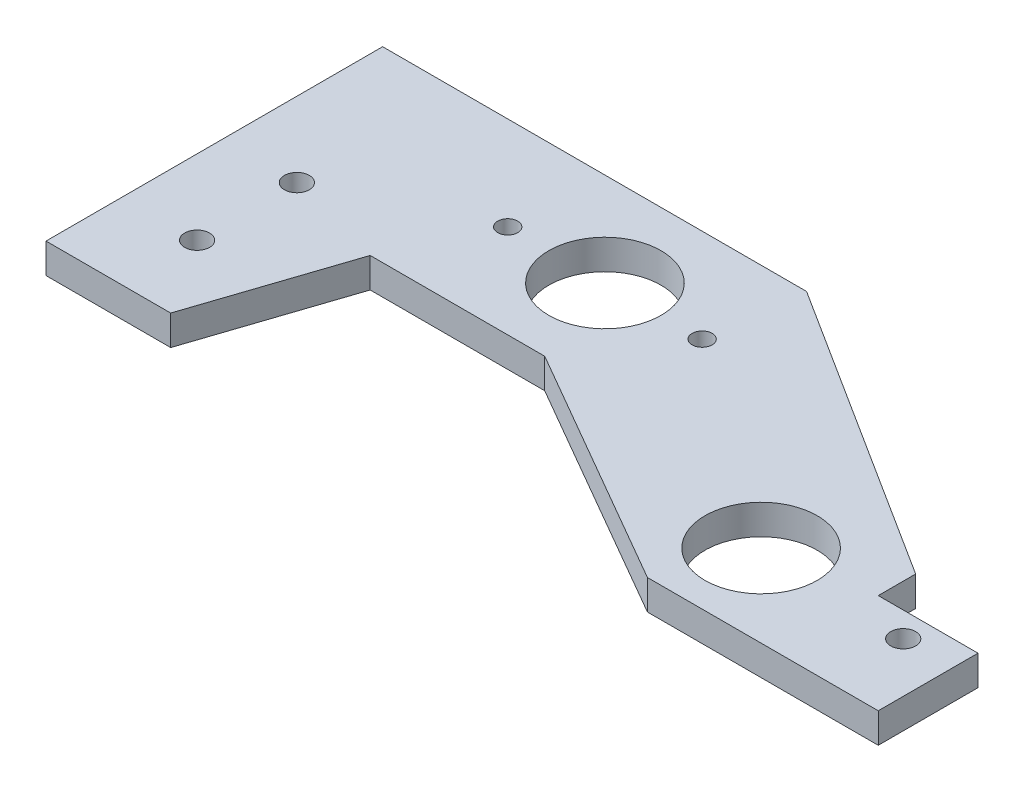
ISO-10303-21;
HEADER;
FILE_DESCRIPTION(('STEP AP214'),'2;1');
FILE_NAME('part.step','',(''),(''),'','','');
FILE_SCHEMA(('AUTOMOTIVE_DESIGN { 1 0 10303 214 1 1 1 1 }'));
ENDSEC;
DATA;
#1=APPLICATION_CONTEXT('core data for automotive mechanical design processes');
#2=APPLICATION_PROTOCOL_DEFINITION('international standard','automotive_design',2000,#1);
#3=PRODUCT_CONTEXT('',#1,'mechanical');
#4=PRODUCT('Part','Part','',(#3));
#5=PRODUCT_RELATED_PRODUCT_CATEGORY('part','',(#4));
#6=PRODUCT_DEFINITION_FORMATION('','',#4);
#7=PRODUCT_DEFINITION_CONTEXT('part definition',#1,'design');
#8=PRODUCT_DEFINITION('design','',#6,#7);
#9=PRODUCT_DEFINITION_SHAPE('','',#8);
#10=(LENGTH_UNIT() NAMED_UNIT(*) SI_UNIT(.MILLI.,.METRE.));
#11=(NAMED_UNIT(*) PLANE_ANGLE_UNIT() SI_UNIT($,.RADIAN.));
#12=(NAMED_UNIT(*) SI_UNIT($,.STERADIAN.) SOLID_ANGLE_UNIT());
#13=UNCERTAINTY_MEASURE_WITH_UNIT(LENGTH_MEASURE(1.E-05),#10,'distance_accuracy_value','');
#14=(GEOMETRIC_REPRESENTATION_CONTEXT(3) GLOBAL_UNCERTAINTY_ASSIGNED_CONTEXT((#13)) GLOBAL_UNIT_ASSIGNED_CONTEXT((#10,
#11,#12)) REPRESENTATION_CONTEXT('',''));
#15=CARTESIAN_POINT('',(0.,0.,0.));
#16=DIRECTION('',(0.,0.,1.));
#17=DIRECTION('',(1.,0.,0.));
#18=AXIS2_PLACEMENT_3D('',#15,#16,#17);
#19=CARTESIAN_POINT('',(25.4,7.62,-13.9541893614266));
#20=DIRECTION('',(-1.,0.,0.));
#21=DIRECTION('',(0.,0.,1.));
#22=AXIS2_PLACEMENT_3D('',#19,#20,#21);
#23=PLANE('',#22);
#24=DIRECTION('',(0.,1.,0.));
#25=VECTOR('',#24,1.);
#26=CARTESIAN_POINT('',(25.4,-35.9210244842766,-4.42918936142656));
#27=LINE('',#26,#25);
#28=CARTESIAN_POINT('',(25.4,0.,-4.42918936142656));
#29=VERTEX_POINT('',#28);
#30=CARTESIAN_POINT('',(25.4,7.62,-4.42918936142656));
#31=VERTEX_POINT('',#30);
#32=EDGE_CURVE('E195',#29,#31,#27,.T.);
#33=ORIENTED_EDGE('',*,*,#32,.F.);
#34=DIRECTION('',(0.,0.,-1.));
#35=VECTOR('',#34,1.);
#36=CARTESIAN_POINT('',(25.4,0.,-13.9541893614266));
#37=LINE('',#36,#35);
#38=CARTESIAN_POINT('',(25.4,0.,-13.9541893614266));
#39=VERTEX_POINT('',#38);
#40=EDGE_CURVE('E299',#29,#39,#37,.T.);
#41=ORIENTED_EDGE('',*,*,#40,.T.);
#42=DIRECTION('',(0.,-1.,0.));
#43=VECTOR('',#42,1.);
#44=CARTESIAN_POINT('',(25.4,7.62,-13.9541893614266));
#45=LINE('',#44,#43);
#46=CARTESIAN_POINT('',(25.4,7.62,-13.9541893614266));
#47=VERTEX_POINT('',#46);
#48=EDGE_CURVE('E11',#47,#39,#45,.T.);
#49=ORIENTED_EDGE('',*,*,#48,.F.);
#50=DIRECTION('',(0.,0.,-1.));
#51=VECTOR('',#50,1.);
#52=CARTESIAN_POINT('',(25.4,7.62,-13.9541893614266));
#53=LINE('',#52,#51);
#54=EDGE_CURVE('E203',#31,#47,#53,.T.);
#55=ORIENTED_EDGE('',*,*,#54,.F.);
#56=EDGE_LOOP('',(#33,#41,#49,#55));
#57=FACE_BOUND('',#56,.T.);
#58=ADVANCED_FACE('F38',(#57),#23,.F.);
#59=CARTESIAN_POINT('',(0.,7.62,0.));
#60=DIRECTION('',(0.,-1.,0.));
#61=DIRECTION('',(0.,0.,-1.));
#62=AXIS2_PLACEMENT_3D('',#59,#60,#61);
#63=PLANE('',#62);
#64=CARTESIAN_POINT('',(-139.7,7.62,3.91987871720376));
#65=DIRECTION('',(0.,1.,0.));
#66=DIRECTION('',(0.,0.,1.));
#67=AXIS2_PLACEMENT_3D('',#64,#65,#66);
#68=CIRCLE('',#67,3.175);
#69=CARTESIAN_POINT('',(-139.7,7.62,7.09487871720376));
#70=VERTEX_POINT('',#69);
#71=EDGE_CURVE('E138',#70,#70,#68,.T.);
#72=ORIENTED_EDGE('',*,*,#71,.F.);
#73=EDGE_LOOP('',(#72));
#74=FACE_BOUND('',#73,.T.);
#75=CARTESIAN_POINT('',(-139.7,7.62,-21.4801212827962));
#76=DIRECTION('',(0.,1.,0.));
#77=DIRECTION('',(0.,0.,1.));
#78=AXIS2_PLACEMENT_3D('',#75,#76,#77);
#79=CIRCLE('',#78,3.175);
#80=CARTESIAN_POINT('',(-139.7,7.62,-18.3051212827962));
#81=VERTEX_POINT('',#80);
#82=EDGE_CURVE('E150',#81,#81,#79,.T.);
#83=ORIENTED_EDGE('',*,*,#82,.F.);
#84=EDGE_LOOP('',(#83));
#85=FACE_BOUND('',#84,.T.);
#86=DIRECTION('',(1.,0.,0.));
#87=VECTOR('',#86,1.);
#88=CARTESIAN_POINT('',(-152.4,7.62,-14.7491212827962));
#89=LINE('',#88,#87);
#90=CARTESIAN_POINT('',(-114.3,7.62,-14.7491212827962));
#91=VERTEX_POINT('',#90);
#92=CARTESIAN_POINT('',(-69.85,7.62,-14.7491212827962));
#93=VERTEX_POINT('',#92);
#94=EDGE_CURVE('E63',#91,#93,#89,.T.);
#95=ORIENTED_EDGE('',*,*,#94,.T.);
#96=DIRECTION('',(-0.866025403784439,0.,-0.5));
#97=VECTOR('',#96,1.);
#98=CARTESIAN_POINT('',(-69.85,7.62,-14.7491212827962));
#99=LINE('',#98,#97);
#100=CARTESIAN_POINT('',(-7.98126306928625,7.62,20.9708106385734));
#101=VERTEX_POINT('',#100);
#102=EDGE_CURVE('E127',#101,#93,#99,.T.);
#103=ORIENTED_EDGE('',*,*,#102,.F.);
#104=DIRECTION('',(1.,0.,0.));
#105=VECTOR('',#104,1.);
#106=CARTESIAN_POINT('',(-14.3312630692865,7.62,20.9708106385734));
#107=LINE('',#106,#105);
#108=CARTESIAN_POINT('',(50.8,7.62,20.9708106385734));
#109=VERTEX_POINT('',#108);
#110=EDGE_CURVE('E132',#101,#109,#107,.T.);
#111=ORIENTED_EDGE('',*,*,#110,.T.);
#112=DIRECTION('',(0.,0.,-1.));
#113=VECTOR('',#112,1.);
#114=CARTESIAN_POINT('',(50.8,7.62,20.9708106385734));
#115=LINE('',#114,#113);
#116=CARTESIAN_POINT('',(50.8,7.62,-4.42918936142656));
#117=VERTEX_POINT('',#116);
#118=EDGE_CURVE('E179',#109,#117,#115,.T.);
#119=ORIENTED_EDGE('',*,*,#118,.T.);
#120=DIRECTION('',(-1.,0.,0.));
#121=VECTOR('',#120,1.);
#122=CARTESIAN_POINT('',(50.8,7.62,-4.42918936142656));
#123=LINE('',#122,#121);
#124=EDGE_CURVE('E182',#117,#31,#123,.T.);
#125=ORIENTED_EDGE('',*,*,#124,.T.);
#126=ORIENTED_EDGE('',*,*,#54,.T.);
#127=DIRECTION('',(-0.844017389806794,0.,-0.536315807807048));
#128=VECTOR('',#127,1.);
#129=CARTESIAN_POINT('',(25.4,7.62,-13.9541893614266));
#130=LINE('',#129,#128);
#131=CARTESIAN_POINT('',(-50.8,7.62,-62.3741212827962));
#132=VERTEX_POINT('',#131);
#133=EDGE_CURVE('E288',#47,#132,#130,.T.);
#134=ORIENTED_EDGE('',*,*,#133,.T.);
#135=DIRECTION('',(-1.,0.,0.));
#136=VECTOR('',#135,1.);
#137=CARTESIAN_POINT('',(-50.8,7.62,-62.3741212827962));
#138=LINE('',#137,#136);
#139=CARTESIAN_POINT('',(-158.75,7.62,-62.3741212827962));
#140=VERTEX_POINT('',#139);
#141=EDGE_CURVE('E293',#132,#140,#138,.T.);
#142=ORIENTED_EDGE('',*,*,#141,.T.);
#143=DIRECTION('',(0.,0.,1.));
#144=VECTOR('',#143,1.);
#145=CARTESIAN_POINT('',(-158.75,7.62,23.3508787172038));
#146=LINE('',#145,#144);
#147=CARTESIAN_POINT('',(-158.75,7.62,23.3508787172038));
#148=VERTEX_POINT('',#147);
#149=EDGE_CURVE('E154',#140,#148,#146,.T.);
#150=ORIENTED_EDGE('',*,*,#149,.T.);
#151=DIRECTION('',(1.,0.,0.));
#152=VECTOR('',#151,1.);
#153=CARTESIAN_POINT('',(-152.4,7.62,23.3508787172038));
#154=LINE('',#153,#152);
#155=CARTESIAN_POINT('',(-127.,7.62,23.3508787172038));
#156=VERTEX_POINT('',#155);
#157=EDGE_CURVE('E157',#148,#156,#154,.T.);
#158=ORIENTED_EDGE('',*,*,#157,.T.);
#159=DIRECTION('',(0.316227766016838,0.,-0.948683298050514));
#160=VECTOR('',#159,1.);
#161=CARTESIAN_POINT('',(-127.,7.62,23.3508787172038));
#162=LINE('',#161,#160);
#163=EDGE_CURVE('E131',#156,#91,#162,.T.);
#164=ORIENTED_EDGE('',*,*,#163,.T.);
#165=EDGE_LOOP('',(#95,#103,#111,#119,#125,#126,#134,#142,#150,#158,#164));
#166=FACE_BOUND('',#165,.T.);
#167=CARTESIAN_POINT('',(-53.5833497406653,7.62,-38.5616212827962));
#168=DIRECTION('',(0.,1.,0.));
#169=DIRECTION('',(0.,0.,1.));
#170=AXIS2_PLACEMENT_3D('',#167,#168,#169);
#171=CIRCLE('',#170,2.5527);
#172=CARTESIAN_POINT('',(-53.5833497406653,7.62,-36.0089212827962));
#173=VERTEX_POINT('',#172);
#174=EDGE_CURVE('E190',#173,#173,#171,.T.);
#175=ORIENTED_EDGE('',*,*,#174,.F.);
#176=EDGE_LOOP('',(#175));
#177=FACE_BOUND('',#176,.T.);
#178=CARTESIAN_POINT('',(-103.087949740665,7.62,-38.5616212827962));
#179=DIRECTION('',(0.,1.,0.));
#180=DIRECTION('',(0.,0.,1.));
#181=AXIS2_PLACEMENT_3D('',#178,#179,#180);
#182=CIRCLE('',#181,2.55270000000001);
#183=CARTESIAN_POINT('',(-103.087949740665,7.62,-36.0089212827962));
#184=VERTEX_POINT('',#183);
#185=EDGE_CURVE('E510',#184,#184,#182,.T.);
#186=ORIENTED_EDGE('',*,*,#185,.F.);
#187=EDGE_LOOP('',(#186));
#188=FACE_BOUND('',#187,.T.);
#189=CARTESIAN_POINT('',(-78.3356497406653,7.62,-38.5616212827962));
#190=DIRECTION('',(0.,1.,0.));
#191=DIRECTION('',(0.,0.,1.));
#192=AXIS2_PLACEMENT_3D('',#189,#190,#191);
#193=CIRCLE('',#192,14.2875);
#194=CARTESIAN_POINT('',(-78.3356497406653,7.62,-24.2741212827963));
#195=VERTEX_POINT('',#194);
#196=EDGE_CURVE('E505',#195,#195,#193,.T.);
#197=ORIENTED_EDGE('',*,*,#196,.F.);
#198=EDGE_LOOP('',(#197));
#199=FACE_BOUND('',#198,.T.);
#200=CARTESIAN_POINT('',(0.,7.62,0.));
#201=DIRECTION('',(0.,1.,0.));
#202=DIRECTION('',(0.,0.,1.));
#203=AXIS2_PLACEMENT_3D('',#200,#201,#202);
#204=CIRCLE('',#203,14.2875);
#205=CARTESIAN_POINT('',(0.,7.62,14.2875));
#206=VERTEX_POINT('',#205);
#207=EDGE_CURVE('E297',#206,#206,#204,.T.);
#208=ORIENTED_EDGE('',*,*,#207,.F.);
#209=EDGE_LOOP('',(#208));
#210=FACE_BOUND('',#209,.T.);
#211=CARTESIAN_POINT('',(38.1,7.62,1.92081063857344));
#212=DIRECTION('',(0.,1.,0.));
#213=DIRECTION('',(0.,0.,1.));
#214=AXIS2_PLACEMENT_3D('',#211,#212,#213);
#215=CIRCLE('',#214,3.175);
#216=CARTESIAN_POINT('',(38.1,7.62,5.09581063857343));
#217=VERTEX_POINT('',#216);
#218=EDGE_CURVE('E183',#217,#217,#215,.T.);
#219=ORIENTED_EDGE('',*,*,#218,.F.);
#220=EDGE_LOOP('',(#219));
#221=FACE_BOUND('',#220,.T.);
#222=ADVANCED_FACE('F124',(#74,#85,#166,#177,#188,#199,#210,#221),#63,.F.);
#223=CARTESIAN_POINT('',(0.,0.,0.));
#224=DIRECTION('',(0.,-1.,0.));
#225=DIRECTION('',(0.,0.,-1.));
#226=AXIS2_PLACEMENT_3D('',#223,#224,#225);
#227=PLANE('',#226);
#228=DIRECTION('',(-0.866025403784439,0.,-0.5));
#229=VECTOR('',#228,1.);
#230=CARTESIAN_POINT('',(-69.85,0.,-14.7491212827962));
#231=LINE('',#230,#229);
#232=CARTESIAN_POINT('',(-7.98126306928624,0.,20.9708106385734));
#233=VERTEX_POINT('',#232);
#234=CARTESIAN_POINT('',(-69.85,0.,-14.7491212827962));
#235=VERTEX_POINT('',#234);
#236=EDGE_CURVE('E55',#233,#235,#231,.T.);
#237=ORIENTED_EDGE('',*,*,#236,.T.);
#238=DIRECTION('',(1.,0.,0.));
#239=VECTOR('',#238,1.);
#240=CARTESIAN_POINT('',(-152.4,0.,-14.7491212827962));
#241=LINE('',#240,#239);
#242=CARTESIAN_POINT('',(-114.3,0.,-14.7491212827962));
#243=VERTEX_POINT('',#242);
#244=EDGE_CURVE('E137',#243,#235,#241,.T.);
#245=ORIENTED_EDGE('',*,*,#244,.F.);
#246=DIRECTION('',(0.316227766016838,0.,-0.948683298050514));
#247=VECTOR('',#246,1.);
#248=CARTESIAN_POINT('',(-127.,0.,23.3508787172038));
#249=LINE('',#248,#247);
#250=CARTESIAN_POINT('',(-127.,0.,23.3508787172038));
#251=VERTEX_POINT('',#250);
#252=EDGE_CURVE('E169',#251,#243,#249,.T.);
#253=ORIENTED_EDGE('',*,*,#252,.F.);
#254=DIRECTION('',(1.,0.,0.));
#255=VECTOR('',#254,1.);
#256=CARTESIAN_POINT('',(-152.4,0.,23.3508787172038));
#257=LINE('',#256,#255);
#258=CARTESIAN_POINT('',(-158.75,0.,23.3508787172038));
#259=VERTEX_POINT('',#258);
#260=EDGE_CURVE('E159',#259,#251,#257,.T.);
#261=ORIENTED_EDGE('',*,*,#260,.F.);
#262=DIRECTION('',(0.,0.,1.));
#263=VECTOR('',#262,1.);
#264=CARTESIAN_POINT('',(-158.75,0.,23.3508787172038));
#265=LINE('',#264,#263);
#266=CARTESIAN_POINT('',(-158.75,0.,-62.3741212827962));
#267=VERTEX_POINT('',#266);
#268=EDGE_CURVE('E164',#267,#259,#265,.T.);
#269=ORIENTED_EDGE('',*,*,#268,.F.);
#270=DIRECTION('',(-1.,0.,0.));
#271=VECTOR('',#270,1.);
#272=CARTESIAN_POINT('',(-50.8,0.,-62.3741212827962));
#273=LINE('',#272,#271);
#274=CARTESIAN_POINT('',(-50.8,0.,-62.3741212827962));
#275=VERTEX_POINT('',#274);
#276=EDGE_CURVE('E133',#275,#267,#273,.T.);
#277=ORIENTED_EDGE('',*,*,#276,.F.);
#278=DIRECTION('',(-0.844017389806794,0.,-0.536315807807048));
#279=VECTOR('',#278,1.);
#280=CARTESIAN_POINT('',(25.4,0.,-13.9541893614266));
#281=LINE('',#280,#279);
#282=EDGE_CURVE('E302',#39,#275,#281,.T.);
#283=ORIENTED_EDGE('',*,*,#282,.F.);
#284=ORIENTED_EDGE('',*,*,#40,.F.);
#285=DIRECTION('',(-1.,0.,0.));
#286=VECTOR('',#285,1.);
#287=CARTESIAN_POINT('',(50.8,0.,-4.42918936142656));
#288=LINE('',#287,#286);
#289=CARTESIAN_POINT('',(50.8,0.,-4.42918936142656));
#290=VERTEX_POINT('',#289);
#291=EDGE_CURVE('E174',#290,#29,#288,.T.);
#292=ORIENTED_EDGE('',*,*,#291,.F.);
#293=DIRECTION('',(0.,0.,-1.));
#294=VECTOR('',#293,1.);
#295=CARTESIAN_POINT('',(50.8,0.,20.9708106385734));
#296=LINE('',#295,#294);
#297=CARTESIAN_POINT('',(50.8,0.,20.9708106385734));
#298=VERTEX_POINT('',#297);
#299=EDGE_CURVE('E191',#298,#290,#296,.T.);
#300=ORIENTED_EDGE('',*,*,#299,.F.);
#301=DIRECTION('',(1.,0.,0.));
#302=VECTOR('',#301,1.);
#303=CARTESIAN_POINT('',(-14.3312630692865,0.,20.9708106385734));
#304=LINE('',#303,#302);
#305=EDGE_CURVE('E296',#233,#298,#304,.T.);
#306=ORIENTED_EDGE('',*,*,#305,.F.);
#307=EDGE_LOOP('',(#237,#245,#253,#261,#269,#277,#283,#284,#292,#300,#306));
#308=FACE_BOUND('',#307,.T.);
#309=CARTESIAN_POINT('',(-139.7,0.,3.91987871720376));
#310=DIRECTION('',(0.,-1.,0.));
#311=DIRECTION('',(0.,0.,-1.));
#312=AXIS2_PLACEMENT_3D('',#309,#310,#311);
#313=CIRCLE('',#312,3.175);
#314=CARTESIAN_POINT('',(-139.7,0.,0.744878717203757));
#315=VERTEX_POINT('',#314);
#316=EDGE_CURVE('E42',#315,#315,#313,.T.);
#317=ORIENTED_EDGE('',*,*,#316,.F.);
#318=EDGE_LOOP('',(#317));
#319=FACE_BOUND('',#318,.T.);
#320=CARTESIAN_POINT('',(-139.7,0.,-21.4801212827962));
#321=DIRECTION('',(0.,-1.,0.));
#322=DIRECTION('',(0.,0.,-1.));
#323=AXIS2_PLACEMENT_3D('',#320,#321,#322);
#324=CIRCLE('',#323,3.175);
#325=CARTESIAN_POINT('',(-139.7,0.,-24.6551212827962));
#326=VERTEX_POINT('',#325);
#327=EDGE_CURVE('E153',#326,#326,#324,.T.);
#328=ORIENTED_EDGE('',*,*,#327,.F.);
#329=EDGE_LOOP('',(#328));
#330=FACE_BOUND('',#329,.T.);
#331=CARTESIAN_POINT('',(-53.5833497406653,0.,-38.5616212827962));
#332=DIRECTION('',(0.,1.,0.));
#333=DIRECTION('',(0.,0.,1.));
#334=AXIS2_PLACEMENT_3D('',#331,#332,#333);
#335=CIRCLE('',#334,2.5527);
#336=CARTESIAN_POINT('',(-53.5833497406653,0.,-36.0089212827962));
#337=VERTEX_POINT('',#336);
#338=EDGE_CURVE('E227',#337,#337,#335,.T.);
#339=ORIENTED_EDGE('',*,*,#338,.T.);
#340=EDGE_LOOP('',(#339));
#341=FACE_BOUND('',#340,.T.);
#342=CARTESIAN_POINT('',(-103.087949740665,0.,-38.5616212827962));
#343=DIRECTION('',(0.,1.,0.));
#344=DIRECTION('',(0.,0.,1.));
#345=AXIS2_PLACEMENT_3D('',#342,#343,#344);
#346=CIRCLE('',#345,2.55270000000001);
#347=CARTESIAN_POINT('',(-103.087949740665,0.,-36.0089212827962));
#348=VERTEX_POINT('',#347);
#349=EDGE_CURVE('E231',#348,#348,#346,.T.);
#350=ORIENTED_EDGE('',*,*,#349,.T.);
#351=EDGE_LOOP('',(#350));
#352=FACE_BOUND('',#351,.T.);
#353=CARTESIAN_POINT('',(-78.3356497406653,0.,-38.5616212827962));
#354=DIRECTION('',(0.,1.,0.));
#355=DIRECTION('',(0.,0.,1.));
#356=AXIS2_PLACEMENT_3D('',#353,#354,#355);
#357=CIRCLE('',#356,14.2875);
#358=CARTESIAN_POINT('',(-78.3356497406653,0.,-24.2741212827963));
#359=VERTEX_POINT('',#358);
#360=EDGE_CURVE('E235',#359,#359,#357,.T.);
#361=ORIENTED_EDGE('',*,*,#360,.T.);
#362=EDGE_LOOP('',(#361));
#363=FACE_BOUND('',#362,.T.);
#364=CARTESIAN_POINT('',(0.,0.,0.));
#365=DIRECTION('',(0.,1.,0.));
#366=DIRECTION('',(0.,0.,1.));
#367=AXIS2_PLACEMENT_3D('',#364,#365,#366);
#368=CIRCLE('',#367,14.2875);
#369=CARTESIAN_POINT('',(0.,0.,14.2875));
#370=VERTEX_POINT('',#369);
#371=EDGE_CURVE('E239',#370,#370,#368,.T.);
#372=ORIENTED_EDGE('',*,*,#371,.T.);
#373=EDGE_LOOP('',(#372));
#374=FACE_BOUND('',#373,.T.);
#375=CARTESIAN_POINT('',(38.1,0.,1.92081063857344));
#376=DIRECTION('',(0.,-1.,0.));
#377=DIRECTION('',(0.,0.,-1.));
#378=AXIS2_PLACEMENT_3D('',#375,#376,#377);
#379=CIRCLE('',#378,3.175);
#380=CARTESIAN_POINT('',(38.1,0.,-1.25418936142656));
#381=VERTEX_POINT('',#380);
#382=EDGE_CURVE('E187',#381,#381,#379,.F.);
#383=ORIENTED_EDGE('',*,*,#382,.T.);
#384=EDGE_LOOP('',(#383));
#385=FACE_BOUND('',#384,.T.);
#386=ADVANCED_FACE('F219',(#308,#319,#330,#341,#352,#363,#374,#385),#227,.T.);
#387=CARTESIAN_POINT('',(-152.4,7.62,-14.7491212827962));
#388=DIRECTION('',(0.,0.,-1.));
#389=DIRECTION('',(-1.,0.,0.));
#390=AXIS2_PLACEMENT_3D('',#387,#388,#389);
#391=PLANE('',#390);
#392=ORIENTED_EDGE('',*,*,#94,.F.);
#393=DIRECTION('',(0.,1.,0.));
#394=VECTOR('',#393,1.);
#395=CARTESIAN_POINT('',(-114.3,-96.5638551684842,-14.7491212827962));
#396=LINE('',#395,#394);
#397=EDGE_CURVE('E172',#243,#91,#396,.T.);
#398=ORIENTED_EDGE('',*,*,#397,.F.);
#399=ORIENTED_EDGE('',*,*,#244,.T.);
#400=DIRECTION('',(0.,1.,0.));
#401=VECTOR('',#400,1.);
#402=CARTESIAN_POINT('',(-69.85,-77.0046076860938,-14.7491212827962));
#403=LINE('',#402,#401);
#404=EDGE_CURVE('E135',#235,#93,#403,.T.);
#405=ORIENTED_EDGE('',*,*,#404,.T.);
#406=EDGE_LOOP('',(#392,#398,#399,#405));
#407=FACE_BOUND('',#406,.T.);
#408=ADVANCED_FACE('F40',(#407),#391,.F.);
#409=CARTESIAN_POINT('',(-14.3312630692865,7.62,20.9708106385734));
#410=DIRECTION('',(0.,0.,-1.));
#411=DIRECTION('',(-1.,0.,0.));
#412=AXIS2_PLACEMENT_3D('',#409,#410,#411);
#413=PLANE('',#412);
#414=ORIENTED_EDGE('',*,*,#110,.F.);
#415=DIRECTION('',(0.,1.,0.));
#416=VECTOR('',#415,1.);
#417=CARTESIAN_POINT('',(-7.98126306928625,-77.0046076860938,20.9708106385734));
#418=LINE('',#417,#416);
#419=EDGE_CURVE('E141',#233,#101,#418,.T.);
#420=ORIENTED_EDGE('',*,*,#419,.F.);
#421=ORIENTED_EDGE('',*,*,#305,.T.);
#422=DIRECTION('',(0.,1.,0.));
#423=VECTOR('',#422,1.);
#424=CARTESIAN_POINT('',(50.8,-35.9210244842766,20.9708106385734));
#425=LINE('',#424,#423);
#426=EDGE_CURVE('E186',#298,#109,#425,.T.);
#427=ORIENTED_EDGE('',*,*,#426,.T.);
#428=EDGE_LOOP('',(#414,#420,#421,#427));
#429=FACE_BOUND('',#428,.T.);
#430=ADVANCED_FACE('F272',(#429),#413,.F.);
#431=CARTESIAN_POINT('',(25.4,7.62,-13.9541893614266));
#432=DIRECTION('',(-0.536315807807048,0.,0.844017389806794));
#433=DIRECTION('',(0.844017389806794,0.,0.536315807807048));
#434=AXIS2_PLACEMENT_3D('',#431,#432,#433);
#435=PLANE('',#434);
#436=ORIENTED_EDGE('',*,*,#282,.T.);
#437=DIRECTION('',(0.,-1.,0.));
#438=VECTOR('',#437,1.);
#439=CARTESIAN_POINT('',(-50.8,7.62,-62.3741212827962));
#440=LINE('',#439,#438);
#441=EDGE_CURVE('E47',#132,#275,#440,.T.);
#442=ORIENTED_EDGE('',*,*,#441,.F.);
#443=ORIENTED_EDGE('',*,*,#133,.F.);
#444=ORIENTED_EDGE('',*,*,#48,.T.);
#445=EDGE_LOOP('',(#436,#442,#443,#444));
#446=FACE_BOUND('',#445,.T.);
#447=ADVANCED_FACE('F270',(#446),#435,.F.);
#448=CARTESIAN_POINT('',(-50.8,7.62,-62.3741212827962));
#449=DIRECTION('',(0.,0.,1.));
#450=DIRECTION('',(1.,0.,0.));
#451=AXIS2_PLACEMENT_3D('',#448,#449,#450);
#452=PLANE('',#451);
#453=ORIENTED_EDGE('',*,*,#276,.T.);
#454=DIRECTION('',(0.,1.,0.));
#455=VECTOR('',#454,1.);
#456=CARTESIAN_POINT('',(-158.75,-96.5638551684842,-62.3741212827962));
#457=LINE('',#456,#455);
#458=EDGE_CURVE('E168',#267,#140,#457,.T.);
#459=ORIENTED_EDGE('',*,*,#458,.T.);
#460=ORIENTED_EDGE('',*,*,#141,.F.);
#461=ORIENTED_EDGE('',*,*,#441,.T.);
#462=EDGE_LOOP('',(#453,#459,#460,#461));
#463=FACE_BOUND('',#462,.T.);
#464=ADVANCED_FACE('F280',(#463),#452,.F.);
#465=CARTESIAN_POINT('',(0.,7.62,0.));
#466=DIRECTION('',(0.,-1.,0.));
#467=DIRECTION('',(0.,0.,-1.));
#468=AXIS2_PLACEMENT_3D('',#465,#466,#467);
#469=CYLINDRICAL_SURFACE('',#468,14.2875);
#470=ORIENTED_EDGE('',*,*,#207,.T.);
#471=EDGE_LOOP('',(#470));
#472=FACE_BOUND('',#471,.T.);
#473=ORIENTED_EDGE('',*,*,#371,.F.);
#474=EDGE_LOOP('',(#473));
#475=FACE_BOUND('',#474,.T.);
#476=ADVANCED_FACE('F352',(#472,#475),#469,.F.);
#477=CARTESIAN_POINT('',(-78.3356497406653,0.,-38.5616212827962));
#478=DIRECTION('',(0.,1.,0.));
#479=DIRECTION('',(0.,0.,1.));
#480=AXIS2_PLACEMENT_3D('',#477,#478,#479);
#481=CYLINDRICAL_SURFACE('',#480,14.2875);
#482=ORIENTED_EDGE('',*,*,#360,.F.);
#483=EDGE_LOOP('',(#482));
#484=FACE_BOUND('',#483,.T.);
#485=ORIENTED_EDGE('',*,*,#196,.T.);
#486=EDGE_LOOP('',(#485));
#487=FACE_BOUND('',#486,.T.);
#488=ADVANCED_FACE('F345',(#484,#487),#481,.F.);
#489=CARTESIAN_POINT('',(-103.087949740665,0.,-38.5616212827962));
#490=DIRECTION('',(0.,1.,0.));
#491=DIRECTION('',(0.,0.,1.));
#492=AXIS2_PLACEMENT_3D('',#489,#490,#491);
#493=CYLINDRICAL_SURFACE('',#492,2.55270000000001);
#494=ORIENTED_EDGE('',*,*,#349,.F.);
#495=EDGE_LOOP('',(#494));
#496=FACE_BOUND('',#495,.T.);
#497=ORIENTED_EDGE('',*,*,#185,.T.);
#498=EDGE_LOOP('',(#497));
#499=FACE_BOUND('',#498,.T.);
#500=ADVANCED_FACE('F340',(#496,#499),#493,.F.);
#501=CARTESIAN_POINT('',(-53.5833497406653,0.,-38.5616212827962));
#502=DIRECTION('',(0.,1.,0.));
#503=DIRECTION('',(0.,0.,1.));
#504=AXIS2_PLACEMENT_3D('',#501,#502,#503);
#505=CYLINDRICAL_SURFACE('',#504,2.5527);
#506=ORIENTED_EDGE('',*,*,#338,.F.);
#507=EDGE_LOOP('',(#506));
#508=FACE_BOUND('',#507,.T.);
#509=ORIENTED_EDGE('',*,*,#174,.T.);
#510=EDGE_LOOP('',(#509));
#511=FACE_BOUND('',#510,.T.);
#512=ADVANCED_FACE('F336',(#508,#511),#505,.F.);
#513=CARTESIAN_POINT('',(50.8,-35.9210244842766,-4.42918936142656));
#514=DIRECTION('',(0.,0.,-1.));
#515=DIRECTION('',(-1.,0.,0.));
#516=AXIS2_PLACEMENT_3D('',#513,#514,#515);
#517=PLANE('',#516);
#518=DIRECTION('',(0.,1.,0.));
#519=VECTOR('',#518,1.);
#520=CARTESIAN_POINT('',(50.8,-35.9210244842766,-4.42918936142656));
#521=LINE('',#520,#519);
#522=EDGE_CURVE('E194',#290,#117,#521,.T.);
#523=ORIENTED_EDGE('',*,*,#522,.F.);
#524=ORIENTED_EDGE('',*,*,#291,.T.);
#525=ORIENTED_EDGE('',*,*,#32,.T.);
#526=ORIENTED_EDGE('',*,*,#124,.F.);
#527=EDGE_LOOP('',(#523,#524,#525,#526));
#528=FACE_BOUND('',#527,.T.);
#529=ADVANCED_FACE('F255',(#528),#517,.T.);
#530=CARTESIAN_POINT('',(50.8,-35.9210244842766,20.9708106385734));
#531=DIRECTION('',(1.,0.,0.));
#532=DIRECTION('',(0.,0.,-1.));
#533=AXIS2_PLACEMENT_3D('',#530,#531,#532);
#534=PLANE('',#533);
#535=ORIENTED_EDGE('',*,*,#426,.F.);
#536=ORIENTED_EDGE('',*,*,#299,.T.);
#537=ORIENTED_EDGE('',*,*,#522,.T.);
#538=ORIENTED_EDGE('',*,*,#118,.F.);
#539=EDGE_LOOP('',(#535,#536,#537,#538));
#540=FACE_BOUND('',#539,.T.);
#541=ADVANCED_FACE('F245',(#540),#534,.T.);
#542=CARTESIAN_POINT('',(38.1,-35.9210244842766,1.92081063857344));
#543=DIRECTION('',(0.,1.,0.));
#544=DIRECTION('',(0.,0.,1.));
#545=AXIS2_PLACEMENT_3D('',#542,#543,#544);
#546=CYLINDRICAL_SURFACE('',#545,3.175);
#547=ORIENTED_EDGE('',*,*,#218,.T.);
#548=EDGE_LOOP('',(#547));
#549=FACE_BOUND('',#548,.T.);
#550=ORIENTED_EDGE('',*,*,#382,.F.);
#551=EDGE_LOOP('',(#550));
#552=FACE_BOUND('',#551,.T.);
#553=ADVANCED_FACE('F242',(#549,#552),#546,.F.);
#554=CARTESIAN_POINT('',(-152.4,-96.5638551684842,23.3508787172038));
#555=DIRECTION('',(0.,0.,1.));
#556=DIRECTION('',(1.,0.,0.));
#557=AXIS2_PLACEMENT_3D('',#554,#555,#556);
#558=PLANE('',#557);
#559=DIRECTION('',(0.,1.,0.));
#560=VECTOR('',#559,1.);
#561=CARTESIAN_POINT('',(-158.75,-96.5638551684842,23.3508787172038));
#562=LINE('',#561,#560);
#563=EDGE_CURVE('E167',#259,#148,#562,.T.);
#564=ORIENTED_EDGE('',*,*,#563,.F.);
#565=ORIENTED_EDGE('',*,*,#260,.T.);
#566=DIRECTION('',(0.,1.,0.));
#567=VECTOR('',#566,1.);
#568=CARTESIAN_POINT('',(-127.,-96.5638551684842,23.3508787172038));
#569=LINE('',#568,#567);
#570=EDGE_CURVE('E163',#251,#156,#569,.T.);
#571=ORIENTED_EDGE('',*,*,#570,.T.);
#572=ORIENTED_EDGE('',*,*,#157,.F.);
#573=EDGE_LOOP('',(#564,#565,#571,#572));
#574=FACE_BOUND('',#573,.T.);
#575=ADVANCED_FACE('F244',(#574),#558,.T.);
#576=CARTESIAN_POINT('',(-127.,-96.5638551684842,23.3508787172038));
#577=DIRECTION('',(0.948683298050514,0.,0.316227766016838));
#578=DIRECTION('',(0.316227766016838,0.,-0.948683298050514));
#579=AXIS2_PLACEMENT_3D('',#576,#577,#578);
#580=PLANE('',#579);
#581=ORIENTED_EDGE('',*,*,#570,.F.);
#582=ORIENTED_EDGE('',*,*,#252,.T.);
#583=ORIENTED_EDGE('',*,*,#397,.T.);
#584=ORIENTED_EDGE('',*,*,#163,.F.);
#585=EDGE_LOOP('',(#581,#582,#583,#584));
#586=FACE_BOUND('',#585,.T.);
#587=ADVANCED_FACE('F252',(#586),#580,.T.);
#588=CARTESIAN_POINT('',(-158.75,-96.5638551684842,23.3508787172038));
#589=DIRECTION('',(-1.,0.,0.));
#590=DIRECTION('',(0.,0.,1.));
#591=AXIS2_PLACEMENT_3D('',#588,#589,#590);
#592=PLANE('',#591);
#593=ORIENTED_EDGE('',*,*,#458,.F.);
#594=ORIENTED_EDGE('',*,*,#268,.T.);
#595=ORIENTED_EDGE('',*,*,#563,.T.);
#596=ORIENTED_EDGE('',*,*,#149,.F.);
#597=EDGE_LOOP('',(#593,#594,#595,#596));
#598=FACE_BOUND('',#597,.T.);
#599=ADVANCED_FACE('F320',(#598),#592,.T.);
#600=CARTESIAN_POINT('',(-139.7,-4.99999999997031E-05,-21.4801212827962));
#601=DIRECTION('',(0.,1.,0.));
#602=DIRECTION('',(0.,0.,1.));
#603=AXIS2_PLACEMENT_3D('',#600,#601,#602);
#604=CYLINDRICAL_SURFACE('',#603,3.175);
#605=ORIENTED_EDGE('',*,*,#327,.T.);
#606=EDGE_LOOP('',(#605));
#607=FACE_BOUND('',#606,.T.);
#608=ORIENTED_EDGE('',*,*,#82,.T.);
#609=EDGE_LOOP('',(#608));
#610=FACE_BOUND('',#609,.T.);
#611=ADVANCED_FACE('F216',(#607,#610),#604,.F.);
#612=CARTESIAN_POINT('',(-139.7,-4.99999999997031E-05,3.91987871720376));
#613=DIRECTION('',(0.,1.,0.));
#614=DIRECTION('',(0.,0.,1.));
#615=AXIS2_PLACEMENT_3D('',#612,#613,#614);
#616=CYLINDRICAL_SURFACE('',#615,3.175);
#617=ORIENTED_EDGE('',*,*,#316,.T.);
#618=EDGE_LOOP('',(#617));
#619=FACE_BOUND('',#618,.T.);
#620=ORIENTED_EDGE('',*,*,#71,.T.);
#621=EDGE_LOOP('',(#620));
#622=FACE_BOUND('',#621,.T.);
#623=ADVANCED_FACE('F448',(#619,#622),#616,.F.);
#624=CARTESIAN_POINT('',(-69.85,-77.0046076860938,-14.7491212827962));
#625=DIRECTION('',(0.5,0.,-0.866025403784439));
#626=DIRECTION('',(-0.866025403784439,0.,-0.5));
#627=AXIS2_PLACEMENT_3D('',#624,#625,#626);
#628=PLANE('',#627);
#629=ORIENTED_EDGE('',*,*,#419,.T.);
#630=ORIENTED_EDGE('',*,*,#102,.T.);
#631=ORIENTED_EDGE('',*,*,#404,.F.);
#632=ORIENTED_EDGE('',*,*,#236,.F.);
#633=EDGE_LOOP('',(#629,#630,#631,#632));
#634=FACE_BOUND('',#633,.T.);
#635=ADVANCED_FACE('F140',(#634),#628,.F.);
#636=CLOSED_SHELL('',(#58,#222,#386,#408,#430,#447,#464,#476,#488,#500,#512,#529,#541,#553,#575,
#587,#599,#611,#623,#635));
#637=MANIFOLD_SOLID_BREP('B2',#636);
#638=ADVANCED_BREP_SHAPE_REPRESENTATION('',(#18,#637),#14);
#639=SHAPE_DEFINITION_REPRESENTATION(#9,#638);
ENDSEC;
END-ISO-10303-21;
